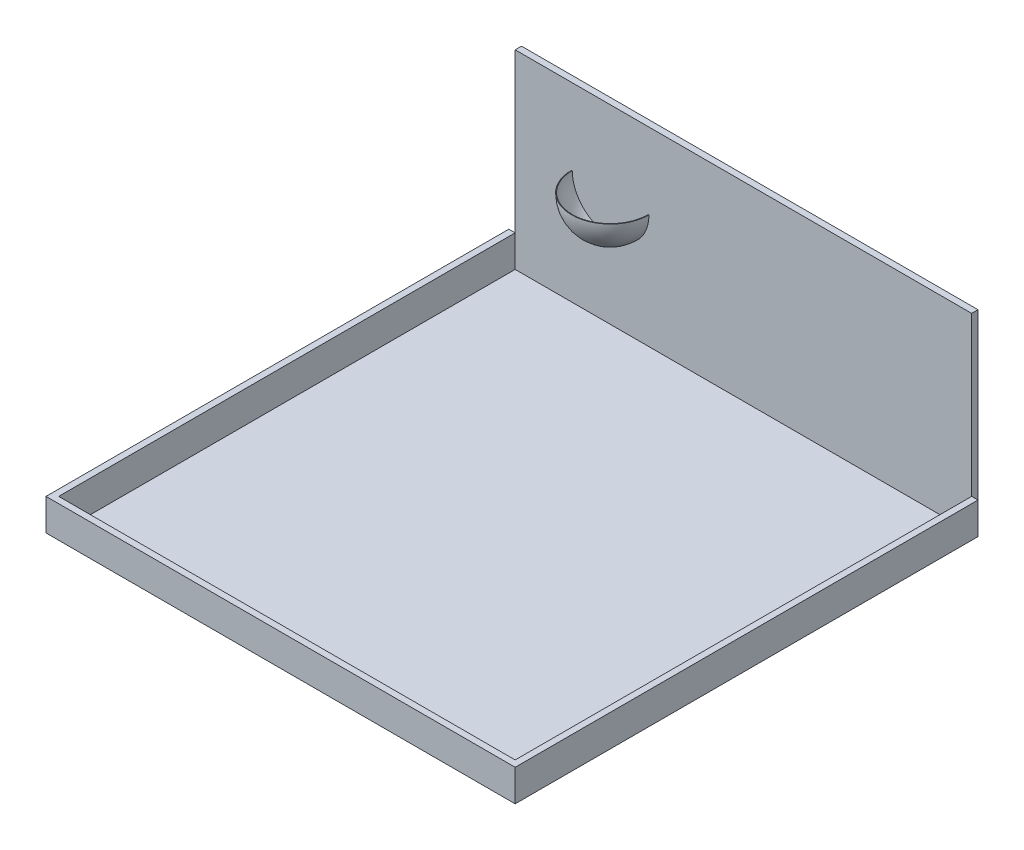
ISO-10303-21;
HEADER;
FILE_DESCRIPTION(('STEP AP214'),'2;1');
FILE_NAME('part.step','',(''),(''),'','','');
FILE_SCHEMA(('AUTOMOTIVE_DESIGN { 1 0 10303 214 1 1 1 1 }'));
ENDSEC;
DATA;
#1=APPLICATION_CONTEXT('core data for automotive mechanical design processes');
#2=APPLICATION_PROTOCOL_DEFINITION('international standard','automotive_design',2000,#1);
#3=PRODUCT_CONTEXT('',#1,'mechanical');
#4=PRODUCT('Part','Part','',(#3));
#5=PRODUCT_RELATED_PRODUCT_CATEGORY('part','',(#4));
#6=PRODUCT_DEFINITION_FORMATION('','',#4);
#7=PRODUCT_DEFINITION_CONTEXT('part definition',#1,'design');
#8=PRODUCT_DEFINITION('design','',#6,#7);
#9=PRODUCT_DEFINITION_SHAPE('','',#8);
#10=(LENGTH_UNIT() NAMED_UNIT(*) SI_UNIT(.MILLI.,.METRE.));
#11=(NAMED_UNIT(*) PLANE_ANGLE_UNIT() SI_UNIT($,.RADIAN.));
#12=(NAMED_UNIT(*) SI_UNIT($,.STERADIAN.) SOLID_ANGLE_UNIT());
#13=UNCERTAINTY_MEASURE_WITH_UNIT(LENGTH_MEASURE(1.E-05),#10,'distance_accuracy_value','');
#14=(GEOMETRIC_REPRESENTATION_CONTEXT(3) GLOBAL_UNCERTAINTY_ASSIGNED_CONTEXT((#13)) GLOBAL_UNIT_ASSIGNED_CONTEXT((#10,
#11,#12)) REPRESENTATION_CONTEXT('',''));
#15=CARTESIAN_POINT('',(0.,0.,0.));
#16=DIRECTION('',(0.,0.,1.));
#17=DIRECTION('',(1.,0.,0.));
#18=AXIS2_PLACEMENT_3D('',#15,#16,#17);
#19=CARTESIAN_POINT('',(-2.22044604925031E-13,152.4,-1828.8));
#20=DIRECTION('',(-1.,0.,0.));
#21=DIRECTION('',(0.,0.,1.));
#22=AXIS2_PLACEMENT_3D('',#19,#20,#21);
#23=PLANE('',#22);
#24=DIRECTION('',(0.,0.,-1.));
#25=VECTOR('',#24,1.);
#26=CARTESIAN_POINT('',(-2.22044604925031E-13,25.4,-1828.8));
#27=LINE('',#26,#25);
#28=CARTESIAN_POINT('',(-2.22044604925031E-13,25.4,0.));
#29=VERTEX_POINT('',#28);
#30=CARTESIAN_POINT('',(-2.22044604925031E-13,25.4,-1828.8));
#31=VERTEX_POINT('',#30);
#32=EDGE_CURVE('E144',#29,#31,#27,.T.);
#33=ORIENTED_EDGE('',*,*,#32,.T.);
#34=DIRECTION('',(0.,-1.,0.));
#35=VECTOR('',#34,1.);
#36=CARTESIAN_POINT('',(-2.22044604925031E-13,152.4,-1828.8));
#37=LINE('',#36,#35);
#38=CARTESIAN_POINT('',(-2.22044604925031E-13,152.4,-1828.8));
#39=VERTEX_POINT('',#38);
#40=EDGE_CURVE('E12',#39,#31,#37,.T.);
#41=ORIENTED_EDGE('',*,*,#40,.F.);
#42=DIRECTION('',(0.,0.,-1.));
#43=VECTOR('',#42,1.);
#44=CARTESIAN_POINT('',(-2.22044604925031E-13,152.4,-1828.8));
#45=LINE('',#44,#43);
#46=CARTESIAN_POINT('',(-2.22044604925031E-13,152.4,0.));
#47=VERTEX_POINT('',#46);
#48=EDGE_CURVE('E158',#47,#39,#45,.T.);
#49=ORIENTED_EDGE('',*,*,#48,.F.);
#50=DIRECTION('',(0.,-1.,0.));
#51=VECTOR('',#50,1.);
#52=CARTESIAN_POINT('',(-2.22044604925031E-13,152.4,0.));
#53=LINE('',#52,#51);
#54=EDGE_CURVE('E140',#47,#29,#53,.T.);
#55=ORIENTED_EDGE('',*,*,#54,.T.);
#56=EDGE_LOOP('',(#33,#41,#49,#55));
#57=FACE_BOUND('',#56,.T.);
#58=ADVANCED_FACE('F48',(#57),#23,.F.);
#59=CARTESIAN_POINT('',(-2.22044604925031E-13,152.4,-1828.8));
#60=DIRECTION('',(0.,0.,1.));
#61=DIRECTION('',(1.,0.,0.));
#62=AXIS2_PLACEMENT_3D('',#59,#60,#61);
#63=PLANE('',#62);
#64=DIRECTION('',(-1.,0.,0.));
#65=VECTOR('',#64,1.);
#66=CARTESIAN_POINT('',(-2.22044604925031E-13,25.4,-1828.8));
#67=LINE('',#66,#65);
#68=CARTESIAN_POINT('',(-25.4,25.4,-1828.8));
#69=VERTEX_POINT('',#68);
#70=EDGE_CURVE('E147',#31,#69,#67,.T.);
#71=ORIENTED_EDGE('',*,*,#70,.T.);
#72=DIRECTION('',(0.,-1.,0.));
#73=VECTOR('',#72,1.);
#74=CARTESIAN_POINT('',(-25.4,152.4,-1828.8));
#75=LINE('',#74,#73);
#76=CARTESIAN_POINT('',(-25.4,152.4,-1828.8));
#77=VERTEX_POINT('',#76);
#78=EDGE_CURVE('E56',#77,#69,#75,.T.);
#79=ORIENTED_EDGE('',*,*,#78,.F.);
#80=DIRECTION('',(-1.,0.,0.));
#81=VECTOR('',#80,1.);
#82=CARTESIAN_POINT('',(-2.22044604925031E-13,152.4,-1828.8));
#83=LINE('',#82,#81);
#84=EDGE_CURVE('E107',#39,#77,#83,.T.);
#85=ORIENTED_EDGE('',*,*,#84,.F.);
#86=ORIENTED_EDGE('',*,*,#40,.T.);
#87=EDGE_LOOP('',(#71,#79,#85,#86));
#88=FACE_BOUND('',#87,.T.);
#89=ADVANCED_FACE('F193',(#88),#63,.F.);
#90=CARTESIAN_POINT('',(-25.4,152.4,-1828.8));
#91=DIRECTION('',(1.,0.,0.));
#92=DIRECTION('',(0.,0.,-1.));
#93=AXIS2_PLACEMENT_3D('',#90,#91,#92);
#94=PLANE('',#93);
#95=DIRECTION('',(0.,0.,1.));
#96=VECTOR('',#95,1.);
#97=CARTESIAN_POINT('',(-25.4,25.4,-1828.8));
#98=LINE('',#97,#96);
#99=CARTESIAN_POINT('',(-25.3999999999998,25.4,25.4));
#100=VERTEX_POINT('',#99);
#101=EDGE_CURVE('E149',#69,#100,#98,.T.);
#102=ORIENTED_EDGE('',*,*,#101,.T.);
#103=DIRECTION('',(0.,-1.,0.));
#104=VECTOR('',#103,1.);
#105=CARTESIAN_POINT('',(-25.3999999999998,152.4,25.4));
#106=LINE('',#105,#104);
#107=CARTESIAN_POINT('',(-25.3999999999998,152.4,25.4));
#108=VERTEX_POINT('',#107);
#109=EDGE_CURVE('E165',#108,#100,#106,.T.);
#110=ORIENTED_EDGE('',*,*,#109,.F.);
#111=DIRECTION('',(0.,0.,1.));
#112=VECTOR('',#111,1.);
#113=CARTESIAN_POINT('',(-25.4,152.4,-1828.8));
#114=LINE('',#113,#112);
#115=EDGE_CURVE('E173',#77,#108,#114,.T.);
#116=ORIENTED_EDGE('',*,*,#115,.F.);
#117=ORIENTED_EDGE('',*,*,#78,.T.);
#118=EDGE_LOOP('',(#102,#110,#116,#117));
#119=FACE_BOUND('',#118,.T.);
#120=ADVANCED_FACE('F171',(#119),#94,.F.);
#121=CARTESIAN_POINT('',(-25.3999999999998,152.4,25.4));
#122=DIRECTION('',(0.,0.,-1.));
#123=DIRECTION('',(-1.,0.,0.));
#124=AXIS2_PLACEMENT_3D('',#121,#122,#123);
#125=PLANE('',#124);
#126=DIRECTION('',(1.,0.,0.));
#127=VECTOR('',#126,1.);
#128=CARTESIAN_POINT('',(-25.3999999999998,25.4,25.4));
#129=LINE('',#128,#127);
#130=CARTESIAN_POINT('',(1854.2,25.4,25.4));
#131=VERTEX_POINT('',#130);
#132=EDGE_CURVE('E151',#100,#131,#129,.T.);
#133=ORIENTED_EDGE('',*,*,#132,.T.);
#134=DIRECTION('',(0.,-1.,0.));
#135=VECTOR('',#134,1.);
#136=CARTESIAN_POINT('',(1854.2,152.4,25.4));
#137=LINE('',#136,#135);
#138=CARTESIAN_POINT('',(1854.2,152.4,25.4));
#139=VERTEX_POINT('',#138);
#140=EDGE_CURVE('E162',#139,#131,#137,.T.);
#141=ORIENTED_EDGE('',*,*,#140,.F.);
#142=DIRECTION('',(1.,0.,0.));
#143=VECTOR('',#142,1.);
#144=CARTESIAN_POINT('',(-25.3999999999998,152.4,25.4));
#145=LINE('',#144,#143);
#146=EDGE_CURVE('E185',#108,#139,#145,.T.);
#147=ORIENTED_EDGE('',*,*,#146,.F.);
#148=ORIENTED_EDGE('',*,*,#109,.T.);
#149=EDGE_LOOP('',(#133,#141,#147,#148));
#150=FACE_BOUND('',#149,.T.);
#151=ADVANCED_FACE('F181',(#150),#125,.F.);
#152=CARTESIAN_POINT('',(1854.2,152.4,-1828.8));
#153=DIRECTION('',(-1.,0.,0.));
#154=DIRECTION('',(0.,0.,1.));
#155=AXIS2_PLACEMENT_3D('',#152,#153,#154);
#156=PLANE('',#155);
#157=DIRECTION('',(0.,0.,-1.));
#158=VECTOR('',#157,1.);
#159=CARTESIAN_POINT('',(1854.2,25.4,-1828.8));
#160=LINE('',#159,#158);
#161=CARTESIAN_POINT('',(1854.2,25.4,-1828.8));
#162=VERTEX_POINT('',#161);
#163=EDGE_CURVE('E153',#131,#162,#160,.T.);
#164=ORIENTED_EDGE('',*,*,#163,.T.);
#165=DIRECTION('',(0.,-1.,0.));
#166=VECTOR('',#165,1.);
#167=CARTESIAN_POINT('',(1854.2,152.4,-1828.8));
#168=LINE('',#167,#166);
#169=CARTESIAN_POINT('',(1854.2,152.4,-1828.8));
#170=VERTEX_POINT('',#169);
#171=EDGE_CURVE('E135',#170,#162,#168,.T.);
#172=ORIENTED_EDGE('',*,*,#171,.F.);
#173=DIRECTION('',(0.,0.,-1.));
#174=VECTOR('',#173,1.);
#175=CARTESIAN_POINT('',(1854.2,152.4,-1828.8));
#176=LINE('',#175,#174);
#177=EDGE_CURVE('E126',#139,#170,#176,.T.);
#178=ORIENTED_EDGE('',*,*,#177,.F.);
#179=ORIENTED_EDGE('',*,*,#140,.T.);
#180=EDGE_LOOP('',(#164,#172,#178,#179));
#181=FACE_BOUND('',#180,.T.);
#182=ADVANCED_FACE('F184',(#181),#156,.F.);
#183=CARTESIAN_POINT('',(1828.8,152.4,-1828.8));
#184=DIRECTION('',(0.,0.,1.));
#185=DIRECTION('',(1.,0.,0.));
#186=AXIS2_PLACEMENT_3D('',#183,#184,#185);
#187=PLANE('',#186);
#188=DIRECTION('',(-1.,0.,0.));
#189=VECTOR('',#188,1.);
#190=CARTESIAN_POINT('',(1828.8,25.4,-1828.8));
#191=LINE('',#190,#189);
#192=CARTESIAN_POINT('',(1828.8,25.4,-1828.8));
#193=VERTEX_POINT('',#192);
#194=EDGE_CURVE('E134',#162,#193,#191,.T.);
#195=ORIENTED_EDGE('',*,*,#194,.T.);
#196=DIRECTION('',(0.,-1.,0.));
#197=VECTOR('',#196,1.);
#198=CARTESIAN_POINT('',(1828.8,152.4,-1828.8));
#199=LINE('',#198,#197);
#200=CARTESIAN_POINT('',(1828.8,152.4,-1828.8));
#201=VERTEX_POINT('',#200);
#202=EDGE_CURVE('E131',#201,#193,#199,.T.);
#203=ORIENTED_EDGE('',*,*,#202,.F.);
#204=DIRECTION('',(-1.,0.,0.));
#205=VECTOR('',#204,1.);
#206=CARTESIAN_POINT('',(1828.8,152.4,-1828.8));
#207=LINE('',#206,#205);
#208=EDGE_CURVE('E120',#170,#201,#207,.T.);
#209=ORIENTED_EDGE('',*,*,#208,.F.);
#210=ORIENTED_EDGE('',*,*,#171,.T.);
#211=EDGE_LOOP('',(#195,#203,#209,#210));
#212=FACE_BOUND('',#211,.T.);
#213=ADVANCED_FACE('F132',(#212),#187,.F.);
#214=CARTESIAN_POINT('',(1828.8,152.4,-1828.8));
#215=DIRECTION('',(1.,0.,0.));
#216=DIRECTION('',(0.,0.,-1.));
#217=AXIS2_PLACEMENT_3D('',#214,#215,#216);
#218=PLANE('',#217);
#219=DIRECTION('',(0.,0.,1.));
#220=VECTOR('',#219,1.);
#221=CARTESIAN_POINT('',(1828.8,25.4,-1828.8));
#222=LINE('',#221,#220);
#223=CARTESIAN_POINT('',(1828.8,25.4,0.));
#224=VERTEX_POINT('',#223);
#225=EDGE_CURVE('E93',#193,#224,#222,.T.);
#226=ORIENTED_EDGE('',*,*,#225,.T.);
#227=DIRECTION('',(0.,-1.,0.));
#228=VECTOR('',#227,1.);
#229=CARTESIAN_POINT('',(1828.8,152.4,0.));
#230=LINE('',#229,#228);
#231=CARTESIAN_POINT('',(1828.8,152.4,0.));
#232=VERTEX_POINT('',#231);
#233=EDGE_CURVE('E136',#232,#224,#230,.T.);
#234=ORIENTED_EDGE('',*,*,#233,.F.);
#235=DIRECTION('',(0.,0.,1.));
#236=VECTOR('',#235,1.);
#237=CARTESIAN_POINT('',(1828.8,152.4,-1828.8));
#238=LINE('',#237,#236);
#239=EDGE_CURVE('E124',#201,#232,#238,.T.);
#240=ORIENTED_EDGE('',*,*,#239,.F.);
#241=ORIENTED_EDGE('',*,*,#202,.T.);
#242=EDGE_LOOP('',(#226,#234,#240,#241));
#243=FACE_BOUND('',#242,.T.);
#244=ADVANCED_FACE('F138',(#243),#218,.F.);
#245=CARTESIAN_POINT('',(-2.22044604925031E-13,152.4,0.));
#246=DIRECTION('',(0.,0.,1.));
#247=DIRECTION('',(1.,0.,0.));
#248=AXIS2_PLACEMENT_3D('',#245,#246,#247);
#249=PLANE('',#248);
#250=DIRECTION('',(-1.,0.,0.));
#251=VECTOR('',#250,1.);
#252=CARTESIAN_POINT('',(-2.22044604925031E-13,25.4,0.));
#253=LINE('',#252,#251);
#254=EDGE_CURVE('E99',#224,#29,#253,.T.);
#255=ORIENTED_EDGE('',*,*,#254,.T.);
#256=ORIENTED_EDGE('',*,*,#54,.F.);
#257=DIRECTION('',(-1.,0.,0.));
#258=VECTOR('',#257,1.);
#259=CARTESIAN_POINT('',(-2.22044604925031E-13,152.4,0.));
#260=LINE('',#259,#258);
#261=EDGE_CURVE('E64',#232,#47,#260,.T.);
#262=ORIENTED_EDGE('',*,*,#261,.F.);
#263=ORIENTED_EDGE('',*,*,#233,.T.);
#264=EDGE_LOOP('',(#255,#256,#262,#263));
#265=FACE_BOUND('',#264,.T.);
#266=ADVANCED_FACE('F209',(#265),#249,.F.);
#267=CARTESIAN_POINT('',(0.,152.4,0.));
#268=DIRECTION('',(0.,1.,0.));
#269=DIRECTION('',(0.,0.,1.));
#270=AXIS2_PLACEMENT_3D('',#267,#268,#269);
#271=PLANE('',#270);
#272=ORIENTED_EDGE('',*,*,#48,.T.);
#273=ORIENTED_EDGE('',*,*,#84,.T.);
#274=ORIENTED_EDGE('',*,*,#115,.T.);
#275=ORIENTED_EDGE('',*,*,#146,.T.);
#276=ORIENTED_EDGE('',*,*,#177,.T.);
#277=ORIENTED_EDGE('',*,*,#208,.T.);
#278=ORIENTED_EDGE('',*,*,#239,.T.);
#279=ORIENTED_EDGE('',*,*,#261,.T.);
#280=EDGE_LOOP('',(#272,#273,#274,#275,#276,#277,#278,#279));
#281=FACE_BOUND('',#280,.T.);
#282=ADVANCED_FACE('F122',(#281),#271,.T.);
#283=CARTESIAN_POINT('',(0.,25.4,0.));
#284=DIRECTION('',(0.,1.,0.));
#285=DIRECTION('',(0.,0.,1.));
#286=AXIS2_PLACEMENT_3D('',#283,#284,#285);
#287=PLANE('',#286);
#288=ORIENTED_EDGE('',*,*,#32,.F.);
#289=ORIENTED_EDGE('',*,*,#254,.F.);
#290=ORIENTED_EDGE('',*,*,#225,.F.);
#291=ORIENTED_EDGE('',*,*,#194,.F.);
#292=ORIENTED_EDGE('',*,*,#163,.F.);
#293=ORIENTED_EDGE('',*,*,#132,.F.);
#294=ORIENTED_EDGE('',*,*,#101,.F.);
#295=ORIENTED_EDGE('',*,*,#70,.F.);
#296=EDGE_LOOP('',(#288,#289,#290,#291,#292,#293,#294,#295));
#297=FACE_BOUND('',#296,.T.);
#298=ADVANCED_FACE('F177',(#297),#287,.F.);
#299=CLOSED_SHELL('',(#58,#89,#120,#151,#182,#213,#244,#266,#282,#298));
#300=MANIFOLD_SOLID_BREP('B2',#299);
#301=CARTESIAN_POINT('',(-2.22044604925031E-13,787.4,-1828.8));
#302=DIRECTION('',(1.,0.,0.));
#303=DIRECTION('',(0.,0.,-1.));
#304=AXIS2_PLACEMENT_3D('',#301,#302,#303);
#305=PLANE('',#304);
#306=DIRECTION('',(0.,0.,1.));
#307=VECTOR('',#306,1.);
#308=CARTESIAN_POINT('',(-2.22044604925031E-13,25.4,-1828.8));
#309=LINE('',#308,#307);
#310=CARTESIAN_POINT('',(0.,25.4,-1854.2));
#311=VERTEX_POINT('',#310);
#312=CARTESIAN_POINT('',(-2.22044604925031E-13,25.4,-1828.8));
#313=VERTEX_POINT('',#312);
#314=EDGE_CURVE('E353',#311,#313,#309,.T.);
#315=ORIENTED_EDGE('',*,*,#314,.T.);
#316=DIRECTION('',(0.,-1.,0.));
#317=VECTOR('',#316,1.);
#318=CARTESIAN_POINT('',(-2.22044604925031E-13,787.4,-1828.8));
#319=LINE('',#318,#317);
#320=CARTESIAN_POINT('',(-2.22044604925031E-13,787.4,-1828.8));
#321=VERTEX_POINT('',#320);
#322=EDGE_CURVE('E46',#321,#313,#319,.T.);
#323=ORIENTED_EDGE('',*,*,#322,.F.);
#324=DIRECTION('',(0.,0.,1.));
#325=VECTOR('',#324,1.);
#326=CARTESIAN_POINT('',(-2.22044604925031E-13,787.4,-1828.8));
#327=LINE('',#326,#325);
#328=CARTESIAN_POINT('',(0.,787.4,-1854.2));
#329=VERTEX_POINT('',#328);
#330=EDGE_CURVE('E354',#329,#321,#327,.T.);
#331=ORIENTED_EDGE('',*,*,#330,.F.);
#332=DIRECTION('',(0.,-1.,0.));
#333=VECTOR('',#332,1.);
#334=CARTESIAN_POINT('',(0.,787.4,-1854.2));
#335=LINE('',#334,#333);
#336=EDGE_CURVE('E364',#329,#311,#335,.T.);
#337=ORIENTED_EDGE('',*,*,#336,.T.);
#338=EDGE_LOOP('',(#315,#323,#331,#337));
#339=FACE_BOUND('',#338,.T.);
#340=ADVANCED_FACE('F285',(#339),#305,.F.);
#341=CARTESIAN_POINT('',(-2.22044604925031E-13,787.4,-1828.8));
#342=DIRECTION('',(0.,0.,-1.));
#343=DIRECTION('',(-1.,0.,0.));
#344=AXIS2_PLACEMENT_3D('',#341,#342,#343);
#345=PLANE('',#344);
#346=CARTESIAN_POINT('',(381.,482.6,-1828.8));
#347=DIRECTION('',(0.,0.,1.));
#348=DIRECTION('',(-1.,0.,0.));
#349=AXIS2_PLACEMENT_3D('',#346,#347,#348);
#350=CIRCLE('',#349,152.4);
#351=CARTESIAN_POINT('',(228.6,482.6,-1828.8));
#352=VERTEX_POINT('',#351);
#353=CARTESIAN_POINT('',(533.4,482.6,-1828.8));
#354=VERTEX_POINT('',#353);
#355=EDGE_CURVE('E299',#352,#354,#350,.T.);
#356=ORIENTED_EDGE('',*,*,#355,.T.);
#357=DIRECTION('',(1.,0.,0.));
#358=VECTOR('',#357,1.);
#359=CARTESIAN_POINT('',(535.94,482.6,-1828.8));
#360=LINE('',#359,#358);
#361=CARTESIAN_POINT('',(535.94,482.6,-1828.8));
#362=VERTEX_POINT('',#361);
#363=EDGE_CURVE('E333',#354,#362,#360,.T.);
#364=ORIENTED_EDGE('',*,*,#363,.T.);
#365=CARTESIAN_POINT('',(381.,482.6,-1828.8));
#366=DIRECTION('',(0.,0.,-1.));
#367=DIRECTION('',(-1.,0.,0.));
#368=AXIS2_PLACEMENT_3D('',#365,#366,#367);
#369=CIRCLE('',#368,154.94);
#370=CARTESIAN_POINT('',(226.06,482.6,-1828.8));
#371=VERTEX_POINT('',#370);
#372=EDGE_CURVE('E338',#362,#371,#369,.T.);
#373=ORIENTED_EDGE('',*,*,#372,.T.);
#374=DIRECTION('',(-1.,0.,0.));
#375=VECTOR('',#374,1.);
#376=CARTESIAN_POINT('',(226.06,482.6,-1828.8));
#377=LINE('',#376,#375);
#378=EDGE_CURVE('E304',#352,#371,#377,.T.);
#379=ORIENTED_EDGE('',*,*,#378,.F.);
#380=EDGE_LOOP('',(#356,#364,#373,#379));
#381=FACE_BOUND('',#380,.T.);
#382=DIRECTION('',(1.,0.,0.));
#383=VECTOR('',#382,1.);
#384=CARTESIAN_POINT('',(-2.22044604925031E-13,25.4,-1828.8));
#385=LINE('',#384,#383);
#386=CARTESIAN_POINT('',(1828.8,25.4,-1828.8));
#387=VERTEX_POINT('',#386);
#388=EDGE_CURVE('E367',#313,#387,#385,.T.);
#389=ORIENTED_EDGE('',*,*,#388,.T.);
#390=DIRECTION('',(0.,-1.,0.));
#391=VECTOR('',#390,1.);
#392=CARTESIAN_POINT('',(1828.8,787.4,-1828.8));
#393=LINE('',#392,#391);
#394=CARTESIAN_POINT('',(1828.8,787.4,-1828.8));
#395=VERTEX_POINT('',#394);
#396=EDGE_CURVE('E292',#395,#387,#393,.T.);
#397=ORIENTED_EDGE('',*,*,#396,.F.);
#398=DIRECTION('',(1.,0.,0.));
#399=VECTOR('',#398,1.);
#400=CARTESIAN_POINT('',(-2.22044604925031E-13,787.4,-1828.8));
#401=LINE('',#400,#399);
#402=EDGE_CURVE('E357',#321,#395,#401,.T.);
#403=ORIENTED_EDGE('',*,*,#402,.F.);
#404=ORIENTED_EDGE('',*,*,#322,.T.);
#405=EDGE_LOOP('',(#389,#397,#403,#404));
#406=FACE_BOUND('',#405,.T.);
#407=ADVANCED_FACE('F335',(#381,#406),#345,.F.);
#408=CARTESIAN_POINT('',(1828.8,787.4,-1828.8));
#409=DIRECTION('',(-1.,0.,0.));
#410=DIRECTION('',(0.,0.,1.));
#411=AXIS2_PLACEMENT_3D('',#408,#409,#410);
#412=PLANE('',#411);
#413=DIRECTION('',(0.,0.,-1.));
#414=VECTOR('',#413,1.);
#415=CARTESIAN_POINT('',(1828.8,25.4,-1828.8));
#416=LINE('',#415,#414);
#417=CARTESIAN_POINT('',(1828.8,25.4,-1854.2));
#418=VERTEX_POINT('',#417);
#419=EDGE_CURVE('E369',#387,#418,#416,.T.);
#420=ORIENTED_EDGE('',*,*,#419,.T.);
#421=DIRECTION('',(0.,-1.,0.));
#422=VECTOR('',#421,1.);
#423=CARTESIAN_POINT('',(1828.8,787.4,-1854.2));
#424=LINE('',#423,#422);
#425=CARTESIAN_POINT('',(1828.8,787.4,-1854.2));
#426=VERTEX_POINT('',#425);
#427=EDGE_CURVE('E374',#426,#418,#424,.T.);
#428=ORIENTED_EDGE('',*,*,#427,.F.);
#429=DIRECTION('',(0.,0.,-1.));
#430=VECTOR('',#429,1.);
#431=CARTESIAN_POINT('',(1828.8,787.4,-1828.8));
#432=LINE('',#431,#430);
#433=EDGE_CURVE('E360',#395,#426,#432,.T.);
#434=ORIENTED_EDGE('',*,*,#433,.F.);
#435=ORIENTED_EDGE('',*,*,#396,.T.);
#436=EDGE_LOOP('',(#420,#428,#434,#435));
#437=FACE_BOUND('',#436,.T.);
#438=ADVANCED_FACE('F381',(#437),#412,.F.);
#439=CARTESIAN_POINT('',(0.,787.4,-1854.2));
#440=DIRECTION('',(0.,0.,1.));
#441=DIRECTION('',(1.,0.,0.));
#442=AXIS2_PLACEMENT_3D('',#439,#440,#441);
#443=PLANE('',#442);
#444=DIRECTION('',(-1.,0.,0.));
#445=VECTOR('',#444,1.);
#446=CARTESIAN_POINT('',(0.,25.4,-1854.2));
#447=LINE('',#446,#445);
#448=EDGE_CURVE('E358',#418,#311,#447,.T.);
#449=ORIENTED_EDGE('',*,*,#448,.T.);
#450=ORIENTED_EDGE('',*,*,#336,.F.);
#451=DIRECTION('',(-1.,0.,0.));
#452=VECTOR('',#451,1.);
#453=CARTESIAN_POINT('',(0.,787.4,-1854.2));
#454=LINE('',#453,#452);
#455=EDGE_CURVE('E362',#426,#329,#454,.T.);
#456=ORIENTED_EDGE('',*,*,#455,.F.);
#457=ORIENTED_EDGE('',*,*,#427,.T.);
#458=EDGE_LOOP('',(#449,#450,#456,#457));
#459=FACE_BOUND('',#458,.T.);
#460=ADVANCED_FACE('F389',(#459),#443,.F.);
#461=CARTESIAN_POINT('',(0.,787.4,0.));
#462=DIRECTION('',(0.,-1.,0.));
#463=DIRECTION('',(0.,0.,-1.));
#464=AXIS2_PLACEMENT_3D('',#461,#462,#463);
#465=PLANE('',#464);
#466=ORIENTED_EDGE('',*,*,#330,.T.);
#467=ORIENTED_EDGE('',*,*,#402,.T.);
#468=ORIENTED_EDGE('',*,*,#433,.T.);
#469=ORIENTED_EDGE('',*,*,#455,.T.);
#470=EDGE_LOOP('',(#466,#467,#468,#469));
#471=FACE_BOUND('',#470,.T.);
#472=ADVANCED_FACE('F395',(#471),#465,.F.);
#473=CARTESIAN_POINT('',(0.,25.4,0.));
#474=DIRECTION('',(0.,-1.,0.));
#475=DIRECTION('',(0.,0.,-1.));
#476=AXIS2_PLACEMENT_3D('',#473,#474,#475);
#477=PLANE('',#476);
#478=ORIENTED_EDGE('',*,*,#314,.F.);
#479=ORIENTED_EDGE('',*,*,#448,.F.);
#480=ORIENTED_EDGE('',*,*,#419,.F.);
#481=ORIENTED_EDGE('',*,*,#388,.F.);
#482=EDGE_LOOP('',(#478,#479,#480,#481));
#483=FACE_BOUND('',#482,.T.);
#484=ADVANCED_FACE('F386',(#483),#477,.T.);
#485=CARTESIAN_POINT('',(381.,482.6,-1828.8));
#486=DIRECTION('',(0.,-1.,0.));
#487=DIRECTION('',(-1.,0.,0.));
#488=AXIS2_PLACEMENT_3D('',#485,#486,#487);
#489=SPHERICAL_SURFACE('',#488,152.4);
#490=CARTESIAN_POINT('',(381.,482.6,-1828.8));
#491=DIRECTION('',(0.,-1.,0.));
#492=DIRECTION('',(0.,0.,-1.));
#493=AXIS2_PLACEMENT_3D('',#490,#491,#492);
#494=CIRCLE('',#493,152.4);
#495=EDGE_CURVE('E346',#354,#352,#494,.T.);
#496=ORIENTED_EDGE('',*,*,#495,.F.);
#497=ORIENTED_EDGE('',*,*,#355,.F.);
#498=EDGE_LOOP('',(#496,#497));
#499=FACE_BOUND('',#498,.T.);
#500=ADVANCED_FACE('F407',(#499),#489,.F.);
#501=CARTESIAN_POINT('',(535.94,482.6,-1828.8));
#502=DIRECTION('',(0.,-1.,0.));
#503=DIRECTION('',(0.,0.,-1.));
#504=AXIS2_PLACEMENT_3D('',#501,#502,#503);
#505=PLANE('',#504);
#506=CARTESIAN_POINT('',(381.,482.6,-1828.8));
#507=DIRECTION('',(0.,-1.,0.));
#508=DIRECTION('',(0.,0.,-1.));
#509=AXIS2_PLACEMENT_3D('',#506,#507,#508);
#510=CIRCLE('',#509,154.94);
#511=EDGE_CURVE('E343',#362,#371,#510,.T.);
#512=ORIENTED_EDGE('',*,*,#511,.F.);
#513=ORIENTED_EDGE('',*,*,#363,.F.);
#514=ORIENTED_EDGE('',*,*,#495,.T.);
#515=ORIENTED_EDGE('',*,*,#378,.T.);
#516=EDGE_LOOP('',(#512,#513,#514,#515));
#517=FACE_BOUND('',#516,.T.);
#518=ADVANCED_FACE('F344',(#517),#505,.F.);
#519=CARTESIAN_POINT('',(381.,482.6,-1828.8));
#520=DIRECTION('',(0.,-1.,0.));
#521=DIRECTION('',(1.,0.,0.));
#522=AXIS2_PLACEMENT_3D('',#519,#520,#521);
#523=SPHERICAL_SURFACE('',#522,154.94);
#524=ORIENTED_EDGE('',*,*,#511,.T.);
#525=ORIENTED_EDGE('',*,*,#372,.F.);
#526=EDGE_LOOP('',(#524,#525));
#527=FACE_BOUND('',#526,.T.);
#528=ADVANCED_FACE('F348',(#527),#523,.T.);
#529=CLOSED_SHELL('',(#340,#407,#438,#460,#472,#484,#500,#518,#528));
#530=MANIFOLD_SOLID_BREP('B6',#529);
#531=CARTESIAN_POINT('',(0.,25.4,0.));
#532=DIRECTION('',(1.,0.,0.));
#533=DIRECTION('',(0.,0.,-1.));
#534=AXIS2_PLACEMENT_3D('',#531,#532,#533);
#535=PLANE('',#534);
#536=DIRECTION('',(0.,0.,1.));
#537=VECTOR('',#536,1.);
#538=CARTESIAN_POINT('',(0.,0.,0.));
#539=LINE('',#538,#537);
#540=CARTESIAN_POINT('',(-2.22044604925031E-13,0.,-1828.8));
#541=VERTEX_POINT('',#540);
#542=CARTESIAN_POINT('',(0.,0.,0.));
#543=VERTEX_POINT('',#542);
#544=EDGE_CURVE('E535',#541,#543,#539,.T.);
#545=ORIENTED_EDGE('',*,*,#544,.T.);
#546=DIRECTION('',(0.,-1.,0.));
#547=VECTOR('',#546,1.);
#548=CARTESIAN_POINT('',(0.,25.4,0.));
#549=LINE('',#548,#547);
#550=CARTESIAN_POINT('',(0.,25.4,0.));
#551=VERTEX_POINT('',#550);
#552=EDGE_CURVE('E283',#551,#543,#549,.T.);
#553=ORIENTED_EDGE('',*,*,#552,.F.);
#554=DIRECTION('',(0.,0.,1.));
#555=VECTOR('',#554,1.);
#556=CARTESIAN_POINT('',(0.,25.4,0.));
#557=LINE('',#556,#555);
#558=CARTESIAN_POINT('',(-2.22044604925031E-13,25.4,-1828.8));
#559=VERTEX_POINT('',#558);
#560=EDGE_CURVE('E523',#559,#551,#557,.T.);
#561=ORIENTED_EDGE('',*,*,#560,.F.);
#562=DIRECTION('',(0.,-1.,0.));
#563=VECTOR('',#562,1.);
#564=CARTESIAN_POINT('',(-2.22044604925031E-13,25.4,-1828.8));
#565=LINE('',#564,#563);
#566=EDGE_CURVE('E531',#559,#541,#565,.T.);
#567=ORIENTED_EDGE('',*,*,#566,.T.);
#568=EDGE_LOOP('',(#545,#553,#561,#567));
#569=FACE_BOUND('',#568,.T.);
#570=ADVANCED_FACE('F472',(#569),#535,.F.);
#571=CARTESIAN_POINT('',(0.,25.4,0.));
#572=DIRECTION('',(0.,0.,-1.));
#573=DIRECTION('',(-1.,0.,0.));
#574=AXIS2_PLACEMENT_3D('',#571,#572,#573);
#575=PLANE('',#574);
#576=DIRECTION('',(1.,0.,0.));
#577=VECTOR('',#576,1.);
#578=CARTESIAN_POINT('',(0.,0.,0.));
#579=LINE('',#578,#577);
#580=CARTESIAN_POINT('',(1828.8,0.,0.));
#581=VERTEX_POINT('',#580);
#582=EDGE_CURVE('E527',#543,#581,#579,.T.);
#583=ORIENTED_EDGE('',*,*,#582,.T.);
#584=DIRECTION('',(0.,-1.,0.));
#585=VECTOR('',#584,1.);
#586=CARTESIAN_POINT('',(1828.8,25.4,0.));
#587=LINE('',#586,#585);
#588=CARTESIAN_POINT('',(1828.8,25.4,0.));
#589=VERTEX_POINT('',#588);
#590=EDGE_CURVE('E480',#589,#581,#587,.T.);
#591=ORIENTED_EDGE('',*,*,#590,.F.);
#592=DIRECTION('',(1.,0.,0.));
#593=VECTOR('',#592,1.);
#594=CARTESIAN_POINT('',(0.,25.4,0.));
#595=LINE('',#594,#593);
#596=EDGE_CURVE('E518',#551,#589,#595,.T.);
#597=ORIENTED_EDGE('',*,*,#596,.F.);
#598=ORIENTED_EDGE('',*,*,#552,.T.);
#599=EDGE_LOOP('',(#583,#591,#597,#598));
#600=FACE_BOUND('',#599,.T.);
#601=ADVANCED_FACE('F526',(#600),#575,.F.);
#602=CARTESIAN_POINT('',(1828.8,25.4,0.));
#603=DIRECTION('',(-1.,0.,0.));
#604=DIRECTION('',(0.,0.,1.));
#605=AXIS2_PLACEMENT_3D('',#602,#603,#604);
#606=PLANE('',#605);
#607=DIRECTION('',(0.,0.,-1.));
#608=VECTOR('',#607,1.);
#609=CARTESIAN_POINT('',(1828.8,0.,0.));
#610=LINE('',#609,#608);
#611=CARTESIAN_POINT('',(1828.8,0.,-1828.8));
#612=VERTEX_POINT('',#611);
#613=EDGE_CURVE('E505',#581,#612,#610,.T.);
#614=ORIENTED_EDGE('',*,*,#613,.T.);
#615=DIRECTION('',(0.,-1.,0.));
#616=VECTOR('',#615,1.);
#617=CARTESIAN_POINT('',(1828.8,25.4,-1828.8));
#618=LINE('',#617,#616);
#619=CARTESIAN_POINT('',(1828.8,25.4,-1828.8));
#620=VERTEX_POINT('',#619);
#621=EDGE_CURVE('E528',#620,#612,#618,.T.);
#622=ORIENTED_EDGE('',*,*,#621,.F.);
#623=DIRECTION('',(0.,0.,-1.));
#624=VECTOR('',#623,1.);
#625=CARTESIAN_POINT('',(1828.8,25.4,0.));
#626=LINE('',#625,#624);
#627=EDGE_CURVE('E521',#589,#620,#626,.T.);
#628=ORIENTED_EDGE('',*,*,#627,.F.);
#629=ORIENTED_EDGE('',*,*,#590,.T.);
#630=EDGE_LOOP('',(#614,#622,#628,#629));
#631=FACE_BOUND('',#630,.T.);
#632=ADVANCED_FACE('F529',(#631),#606,.F.);
#633=CARTESIAN_POINT('',(-2.22044604925031E-13,25.4,-1828.8));
#634=DIRECTION('',(0.,0.,1.));
#635=DIRECTION('',(1.,0.,0.));
#636=AXIS2_PLACEMENT_3D('',#633,#634,#635);
#637=PLANE('',#636);
#638=DIRECTION('',(-1.,0.,0.));
#639=VECTOR('',#638,1.);
#640=CARTESIAN_POINT('',(-2.22044604925031E-13,0.,-1828.8));
#641=LINE('',#640,#639);
#642=EDGE_CURVE('E511',#612,#541,#641,.T.);
#643=ORIENTED_EDGE('',*,*,#642,.T.);
#644=ORIENTED_EDGE('',*,*,#566,.F.);
#645=DIRECTION('',(-1.,0.,0.));
#646=VECTOR('',#645,1.);
#647=CARTESIAN_POINT('',(-2.22044604925031E-13,25.4,-1828.8));
#648=LINE('',#647,#646);
#649=EDGE_CURVE('E488',#620,#559,#648,.T.);
#650=ORIENTED_EDGE('',*,*,#649,.F.);
#651=ORIENTED_EDGE('',*,*,#621,.T.);
#652=EDGE_LOOP('',(#643,#644,#650,#651));
#653=FACE_BOUND('',#652,.T.);
#654=ADVANCED_FACE('F542',(#653),#637,.F.);
#655=CARTESIAN_POINT('',(0.,25.4,0.));
#656=DIRECTION('',(0.,-1.,0.));
#657=DIRECTION('',(0.,0.,-1.));
#658=AXIS2_PLACEMENT_3D('',#655,#656,#657);
#659=PLANE('',#658);
#660=ORIENTED_EDGE('',*,*,#560,.T.);
#661=ORIENTED_EDGE('',*,*,#596,.T.);
#662=ORIENTED_EDGE('',*,*,#627,.T.);
#663=ORIENTED_EDGE('',*,*,#649,.T.);
#664=EDGE_LOOP('',(#660,#661,#662,#663));
#665=FACE_BOUND('',#664,.T.);
#666=ADVANCED_FACE('F519',(#665),#659,.F.);
#667=CARTESIAN_POINT('',(0.,0.,0.));
#668=DIRECTION('',(0.,-1.,0.));
#669=DIRECTION('',(0.,0.,-1.));
#670=AXIS2_PLACEMENT_3D('',#667,#668,#669);
#671=PLANE('',#670);
#672=ORIENTED_EDGE('',*,*,#544,.F.);
#673=ORIENTED_EDGE('',*,*,#642,.F.);
#674=ORIENTED_EDGE('',*,*,#613,.F.);
#675=ORIENTED_EDGE('',*,*,#582,.F.);
#676=EDGE_LOOP('',(#672,#673,#674,#675));
#677=FACE_BOUND('',#676,.T.);
#678=ADVANCED_FACE('F545',(#677),#671,.T.);
#679=CLOSED_SHELL('',(#570,#601,#632,#654,#666,#678));
#680=MANIFOLD_SOLID_BREP('B40',#679);
#681=ADVANCED_BREP_SHAPE_REPRESENTATION('',(#18,#300,#530,#680),#14);
#682=SHAPE_DEFINITION_REPRESENTATION(#9,#681);
ENDSEC;
END-ISO-10303-21;
